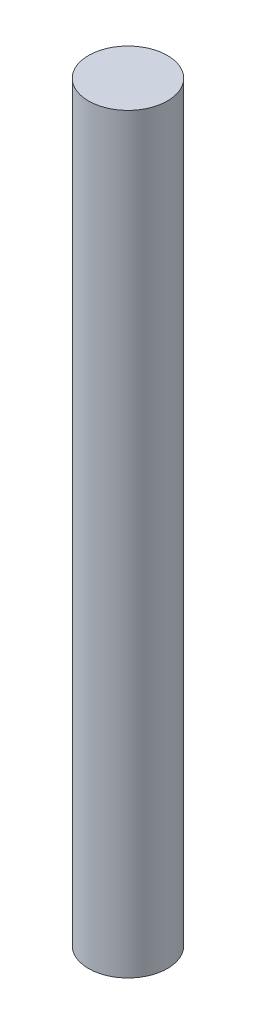
ISO-10303-21;
HEADER;
FILE_DESCRIPTION(('STEP AP214'),'2;1');
FILE_NAME('part.step','',(''),(''),'','','');
FILE_SCHEMA(('AUTOMOTIVE_DESIGN { 1 0 10303 214 1 1 1 1 }'));
ENDSEC;
DATA;
#1=APPLICATION_CONTEXT('core data for automotive mechanical design processes');
#2=APPLICATION_PROTOCOL_DEFINITION('international standard','automotive_design',2000,#1);
#3=PRODUCT_CONTEXT('',#1,'mechanical');
#4=PRODUCT('Part','Part','',(#3));
#5=PRODUCT_RELATED_PRODUCT_CATEGORY('part','',(#4));
#6=PRODUCT_DEFINITION_FORMATION('','',#4);
#7=PRODUCT_DEFINITION_CONTEXT('part definition',#1,'design');
#8=PRODUCT_DEFINITION('design','',#6,#7);
#9=PRODUCT_DEFINITION_SHAPE('','',#8);
#10=(LENGTH_UNIT() NAMED_UNIT(*) SI_UNIT(.MILLI.,.METRE.));
#11=(NAMED_UNIT(*) PLANE_ANGLE_UNIT() SI_UNIT($,.RADIAN.));
#12=(NAMED_UNIT(*) SI_UNIT($,.STERADIAN.) SOLID_ANGLE_UNIT());
#13=UNCERTAINTY_MEASURE_WITH_UNIT(LENGTH_MEASURE(1.E-05),#10,'distance_accuracy_value','');
#14=(GEOMETRIC_REPRESENTATION_CONTEXT(3) GLOBAL_UNCERTAINTY_ASSIGNED_CONTEXT((#13)) GLOBAL_UNIT_ASSIGNED_CONTEXT((#10,
#11,#12)) REPRESENTATION_CONTEXT('',''));
#15=CARTESIAN_POINT('',(0.,0.,0.));
#16=DIRECTION('',(0.,0.,1.));
#17=DIRECTION('',(1.,0.,0.));
#18=AXIS2_PLACEMENT_3D('',#15,#16,#17);
#19=CARTESIAN_POINT('',(0.,38.1,0.));
#20=DIRECTION('',(0.,-1.,0.));
#21=DIRECTION('',(0.,0.,-1.));
#22=AXIS2_PLACEMENT_3D('',#19,#20,#21);
#23=CYLINDRICAL_SURFACE('',#22,2.);
#24=CARTESIAN_POINT('',(0.,38.1,0.));
#25=DIRECTION('',(0.,1.,0.));
#26=DIRECTION('',(0.,0.,1.));
#27=AXIS2_PLACEMENT_3D('',#24,#25,#26);
#28=CIRCLE('',#27,2.);
#29=CARTESIAN_POINT('',(0.,38.1,2.));
#30=VERTEX_POINT('',#29);
#31=EDGE_CURVE('E10',#30,#30,#28,.T.);
#32=ORIENTED_EDGE('',*,*,#31,.F.);
#33=EDGE_LOOP('',(#32));
#34=FACE_BOUND('',#33,.T.);
#35=CARTESIAN_POINT('',(0.,0.,0.));
#36=DIRECTION('',(0.,1.,0.));
#37=DIRECTION('',(0.,0.,1.));
#38=AXIS2_PLACEMENT_3D('',#35,#36,#37);
#39=CIRCLE('',#38,2.);
#40=CARTESIAN_POINT('',(0.,0.,2.));
#41=VERTEX_POINT('',#40);
#42=EDGE_CURVE('E33',#41,#41,#39,.T.);
#43=ORIENTED_EDGE('',*,*,#42,.T.);
#44=EDGE_LOOP('',(#43));
#45=FACE_BOUND('',#44,.T.);
#46=ADVANCED_FACE('F30',(#34,#45),#23,.T.);
#47=CARTESIAN_POINT('',(0.,38.1,0.));
#48=DIRECTION('',(0.,1.,0.));
#49=DIRECTION('',(0.,0.,1.));
#50=AXIS2_PLACEMENT_3D('',#47,#48,#49);
#51=PLANE('',#50);
#52=ORIENTED_EDGE('',*,*,#31,.T.);
#53=EDGE_LOOP('',(#52));
#54=FACE_BOUND('',#53,.T.);
#55=ADVANCED_FACE('F45',(#54),#51,.T.);
#56=CARTESIAN_POINT('',(0.,0.,0.));
#57=DIRECTION('',(0.,1.,0.));
#58=DIRECTION('',(0.,0.,1.));
#59=AXIS2_PLACEMENT_3D('',#56,#57,#58);
#60=PLANE('',#59);
#61=ORIENTED_EDGE('',*,*,#42,.F.);
#62=EDGE_LOOP('',(#61));
#63=FACE_BOUND('',#62,.T.);
#64=ADVANCED_FACE('F43',(#63),#60,.F.);
#65=CLOSED_SHELL('',(#46,#55,#64));
#66=MANIFOLD_SOLID_BREP('B2',#65);
#67=ADVANCED_BREP_SHAPE_REPRESENTATION('',(#18,#66),#14);
#68=SHAPE_DEFINITION_REPRESENTATION(#9,#67);
ENDSEC;
END-ISO-10303-21;
